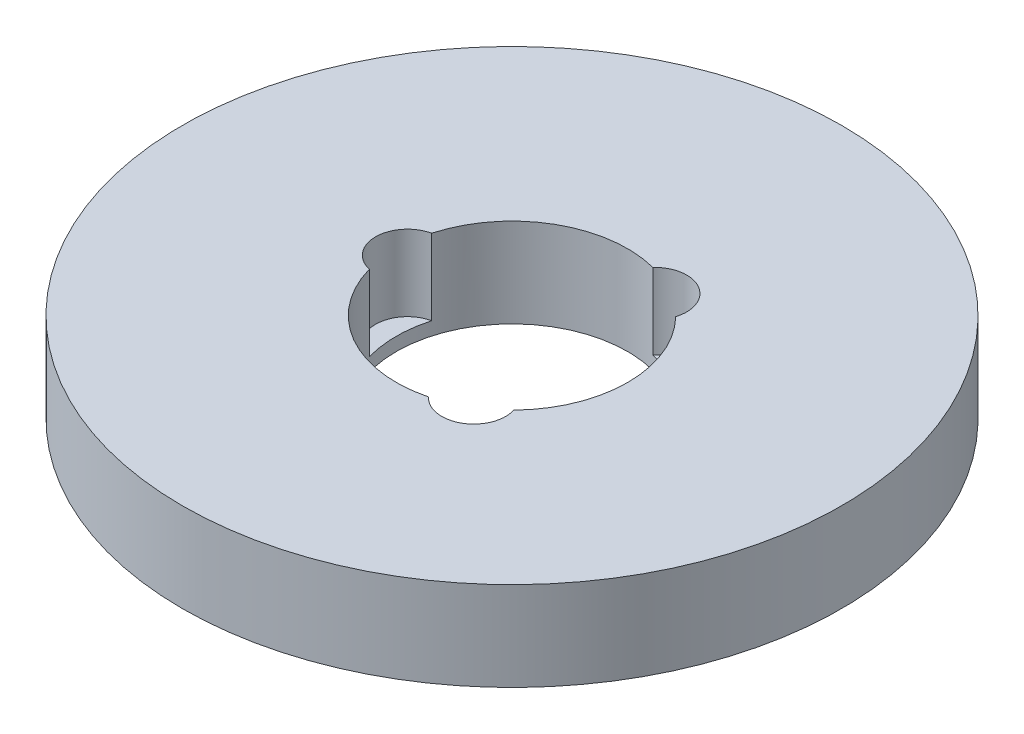
ISO-10303-21;
HEADER;
FILE_DESCRIPTION(('STEP AP214'),'2;1');
FILE_NAME('part.step','',(''),(''),'','','');
FILE_SCHEMA(('AUTOMOTIVE_DESIGN { 1 0 10303 214 1 1 1 1 }'));
ENDSEC;
DATA;
#1=APPLICATION_CONTEXT('core data for automotive mechanical design processes');
#2=APPLICATION_PROTOCOL_DEFINITION('international standard','automotive_design',2000,#1);
#3=PRODUCT_CONTEXT('',#1,'mechanical');
#4=PRODUCT('Part','Part','',(#3));
#5=PRODUCT_RELATED_PRODUCT_CATEGORY('part','',(#4));
#6=PRODUCT_DEFINITION_FORMATION('','',#4);
#7=PRODUCT_DEFINITION_CONTEXT('part definition',#1,'design');
#8=PRODUCT_DEFINITION('design','',#6,#7);
#9=PRODUCT_DEFINITION_SHAPE('','',#8);
#10=(LENGTH_UNIT() NAMED_UNIT(*) SI_UNIT(.MILLI.,.METRE.));
#11=(NAMED_UNIT(*) PLANE_ANGLE_UNIT() SI_UNIT($,.RADIAN.));
#12=(NAMED_UNIT(*) SI_UNIT($,.STERADIAN.) SOLID_ANGLE_UNIT());
#13=UNCERTAINTY_MEASURE_WITH_UNIT(LENGTH_MEASURE(1.E-05),#10,'distance_accuracy_value','');
#14=(GEOMETRIC_REPRESENTATION_CONTEXT(3) GLOBAL_UNCERTAINTY_ASSIGNED_CONTEXT((#13)) GLOBAL_UNIT_ASSIGNED_CONTEXT((#10,
#11,#12)) REPRESENTATION_CONTEXT('',''));
#15=CARTESIAN_POINT('',(0.,0.,0.));
#16=DIRECTION('',(0.,0.,1.));
#17=DIRECTION('',(1.,0.,0.));
#18=AXIS2_PLACEMENT_3D('',#15,#16,#17);
#19=CARTESIAN_POINT('',(0.,25.,0.));
#20=DIRECTION('',(0.,-1.,0.));
#21=DIRECTION('',(0.,0.,-1.));
#22=AXIS2_PLACEMENT_3D('',#19,#20,#21);
#23=CYLINDRICAL_SURFACE('',#22,92.5);
#24=CARTESIAN_POINT('',(0.,25.,0.));
#25=DIRECTION('',(0.,1.,0.));
#26=DIRECTION('',(0.,0.,1.));
#27=AXIS2_PLACEMENT_3D('',#24,#25,#26);
#28=CIRCLE('',#27,92.5);
#29=CARTESIAN_POINT('',(0.,25.,92.5));
#30=VERTEX_POINT('',#29);
#31=EDGE_CURVE('E130',#30,#30,#28,.T.);
#32=ORIENTED_EDGE('',*,*,#31,.F.);
#33=EDGE_LOOP('',(#32));
#34=FACE_BOUND('',#33,.T.);
#35=CARTESIAN_POINT('',(0.,0.,0.));
#36=DIRECTION('',(0.,1.,0.));
#37=DIRECTION('',(0.,0.,1.));
#38=AXIS2_PLACEMENT_3D('',#35,#36,#37);
#39=CIRCLE('',#38,92.5);
#40=CARTESIAN_POINT('',(0.,0.,92.5));
#41=VERTEX_POINT('',#40);
#42=EDGE_CURVE('E117',#41,#41,#39,.T.);
#43=ORIENTED_EDGE('',*,*,#42,.T.);
#44=EDGE_LOOP('',(#43));
#45=FACE_BOUND('',#44,.T.);
#46=ADVANCED_FACE('F39',(#34,#45),#23,.T.);
#47=CARTESIAN_POINT('',(0.,25.,0.));
#48=DIRECTION('',(0.,1.,0.));
#49=DIRECTION('',(0.,0.,1.));
#50=AXIS2_PLACEMENT_3D('',#47,#48,#49);
#51=PLANE('',#50);
#52=CARTESIAN_POINT('',(14.6615317858549,25.,25.3945179698865));
#53=DIRECTION('',(0.,1.,0.));
#54=DIRECTION('',(0.866025403784436,0.,-0.500000000000004));
#55=AXIS2_PLACEMENT_3D('',#52,#53,#54);
#56=CIRCLE('',#55,8.9815388974926);
#57=CARTESIAN_POINT('',(8.06015384169916,25.,31.4846616632312));
#58=VERTEX_POINT('',#57);
#59=CARTESIAN_POINT('',(23.2364399090669,25.,22.7226288169376));
#60=VERTEX_POINT('',#59);
#61=EDGE_CURVE('E148',#58,#60,#56,.T.);
#62=ORIENTED_EDGE('',*,*,#61,.F.);
#63=CARTESIAN_POINT('',(0.,25.,0.));
#64=DIRECTION('',(0.,1.,0.));
#65=DIRECTION('',(0.,0.,1.));
#66=AXIS2_PLACEMENT_3D('',#63,#64,#65);
#67=CIRCLE('',#66,32.5);
#68=CARTESIAN_POINT('',(-31.2965937507658,25.,8.76203284629355));
#69=VERTEX_POINT('',#68);
#70=EDGE_CURVE('E113',#69,#58,#67,.T.);
#71=ORIENTED_EDGE('',*,*,#70,.F.);
#72=CARTESIAN_POINT('',(-29.3230635717096,25.,0.));
#73=DIRECTION('',(0.,1.,0.));
#74=DIRECTION('',(0.,0.,1.));
#75=AXIS2_PLACEMENT_3D('',#72,#73,#74);
#76=CIRCLE('',#75,8.9815388974926);
#77=CARTESIAN_POINT('',(-31.2965937507658,25.,-8.76203284629355));
#78=VERTEX_POINT('',#77);
#79=EDGE_CURVE('E125',#78,#69,#76,.T.);
#80=ORIENTED_EDGE('',*,*,#79,.F.);
#81=CARTESIAN_POINT('',(8.06015384169872,25.,-31.4846616632313));
#82=VERTEX_POINT('',#81);
#83=EDGE_CURVE('E107',#82,#78,#67,.T.);
#84=ORIENTED_EDGE('',*,*,#83,.F.);
#85=CARTESIAN_POINT('',(14.6615317858546,25.,-25.3945179698867));
#86=DIRECTION('',(0.,1.,0.));
#87=DIRECTION('',(-0.866025403784443,0.,-0.499999999999992));
#88=AXIS2_PLACEMENT_3D('',#85,#86,#87);
#89=CIRCLE('',#88,8.9815388974926);
#90=CARTESIAN_POINT('',(23.2364399090666,25.,-22.7226288169379));
#91=VERTEX_POINT('',#90);
#92=EDGE_CURVE('E95',#91,#82,#89,.T.);
#93=ORIENTED_EDGE('',*,*,#92,.F.);
#94=EDGE_CURVE('E106',#60,#91,#67,.T.);
#95=ORIENTED_EDGE('',*,*,#94,.F.);
#96=EDGE_LOOP('',(#62,#71,#80,#84,#93,#95));
#97=FACE_BOUND('',#96,.T.);
#98=ORIENTED_EDGE('',*,*,#31,.T.);
#99=EDGE_LOOP('',(#98));
#100=FACE_BOUND('',#99,.T.);
#101=ADVANCED_FACE('F102',(#97,#100),#51,.T.);
#102=CARTESIAN_POINT('',(0.,0.,0.));
#103=DIRECTION('',(0.,1.,0.));
#104=DIRECTION('',(0.,0.,1.));
#105=AXIS2_PLACEMENT_3D('',#102,#103,#104);
#106=PLANE('',#105);
#107=CARTESIAN_POINT('',(0.,0.,0.));
#108=DIRECTION('',(0.,1.,0.));
#109=DIRECTION('',(0.,0.,1.));
#110=AXIS2_PLACEMENT_3D('',#107,#108,#109);
#111=CIRCLE('',#110,32.5);
#112=CARTESIAN_POINT('',(0.,0.,32.5));
#113=VERTEX_POINT('',#112);
#114=EDGE_CURVE('E118',#113,#113,#111,.T.);
#115=ORIENTED_EDGE('',*,*,#114,.T.);
#116=EDGE_LOOP('',(#115));
#117=FACE_BOUND('',#116,.T.);
#118=ORIENTED_EDGE('',*,*,#42,.F.);
#119=EDGE_LOOP('',(#118));
#120=FACE_BOUND('',#119,.T.);
#121=ADVANCED_FACE('F161',(#117,#120),#106,.F.);
#122=CARTESIAN_POINT('',(0.,25.,0.));
#123=DIRECTION('',(0.,-1.,0.));
#124=DIRECTION('',(0.,0.,-1.));
#125=AXIS2_PLACEMENT_3D('',#122,#123,#124);
#126=CYLINDRICAL_SURFACE('',#125,32.5);
#127=DIRECTION('',(0.,1.,0.));
#128=VECTOR('',#127,1.);
#129=CARTESIAN_POINT('',(8.06015384169915,14.3632524422824,31.4846616632312));
#130=LINE('',#129,#128);
#131=CARTESIAN_POINT('',(8.06015384169916,3.72650488456475,31.4846616632312));
#132=VERTEX_POINT('',#131);
#133=EDGE_CURVE('E11',#132,#58,#130,.T.);
#134=ORIENTED_EDGE('',*,*,#133,.F.);
#135=CARTESIAN_POINT('',(0.,3.72650488456475,0.));
#136=DIRECTION('',(0.,1.,0.));
#137=DIRECTION('',(0.,0.,1.));
#138=AXIS2_PLACEMENT_3D('',#135,#136,#137);
#139=CIRCLE('',#138,32.5);
#140=CARTESIAN_POINT('',(23.2364399090669,3.72650488456475,22.7226288169376));
#141=VERTEX_POINT('',#140);
#142=EDGE_CURVE('E100',#132,#141,#139,.T.);
#143=ORIENTED_EDGE('',*,*,#142,.T.);
#144=DIRECTION('',(0.,1.,0.));
#145=VECTOR('',#144,1.);
#146=CARTESIAN_POINT('',(23.2364399090669,14.3632524422824,22.7226288169376));
#147=LINE('',#146,#145);
#148=EDGE_CURVE('E46',#60,#141,#147,.F.);
#149=ORIENTED_EDGE('',*,*,#148,.F.);
#150=ORIENTED_EDGE('',*,*,#94,.T.);
#151=DIRECTION('',(0.,1.,0.));
#152=VECTOR('',#151,1.);
#153=CARTESIAN_POINT('',(23.2364399090666,14.3632524422824,-22.7226288169379));
#154=LINE('',#153,#152);
#155=CARTESIAN_POINT('',(23.2364399090666,3.72650488456475,-22.7226288169379));
#156=VERTEX_POINT('',#155);
#157=EDGE_CURVE('E90',#156,#91,#154,.T.);
#158=ORIENTED_EDGE('',*,*,#157,.F.);
#159=CARTESIAN_POINT('',(0.,3.72650488456475,0.));
#160=DIRECTION('',(0.,1.,0.));
#161=DIRECTION('',(0.,0.,1.));
#162=AXIS2_PLACEMENT_3D('',#159,#160,#161);
#163=CIRCLE('',#162,32.5);
#164=CARTESIAN_POINT('',(8.06015384169872,3.72650488456475,-31.4846616632313));
#165=VERTEX_POINT('',#164);
#166=EDGE_CURVE('E143',#156,#165,#163,.T.);
#167=ORIENTED_EDGE('',*,*,#166,.T.);
#168=DIRECTION('',(0.,1.,0.));
#169=VECTOR('',#168,1.);
#170=CARTESIAN_POINT('',(8.06015384169872,14.3632524422824,-31.4846616632313));
#171=LINE('',#170,#169);
#172=EDGE_CURVE('E98',#82,#165,#171,.F.);
#173=ORIENTED_EDGE('',*,*,#172,.F.);
#174=ORIENTED_EDGE('',*,*,#83,.T.);
#175=DIRECTION('',(0.,1.,0.));
#176=VECTOR('',#175,1.);
#177=CARTESIAN_POINT('',(-31.2965937507658,14.3632524422824,-8.76203284629355));
#178=LINE('',#177,#176);
#179=CARTESIAN_POINT('',(-31.2965937507658,3.72650488456475,-8.76203284629355));
#180=VERTEX_POINT('',#179);
#181=EDGE_CURVE('E137',#180,#78,#178,.T.);
#182=ORIENTED_EDGE('',*,*,#181,.F.);
#183=CARTESIAN_POINT('',(0.,3.72650488456475,0.));
#184=DIRECTION('',(0.,1.,0.));
#185=DIRECTION('',(0.,0.,1.));
#186=AXIS2_PLACEMENT_3D('',#183,#184,#185);
#187=CIRCLE('',#186,32.5);
#188=CARTESIAN_POINT('',(-31.2965937507658,3.72650488456475,8.76203284629355));
#189=VERTEX_POINT('',#188);
#190=EDGE_CURVE('E128',#180,#189,#187,.T.);
#191=ORIENTED_EDGE('',*,*,#190,.T.);
#192=DIRECTION('',(0.,1.,0.));
#193=VECTOR('',#192,1.);
#194=CARTESIAN_POINT('',(-31.2965937507658,14.3632524422824,8.76203284629355));
#195=LINE('',#194,#193);
#196=EDGE_CURVE('E134',#69,#189,#195,.F.);
#197=ORIENTED_EDGE('',*,*,#196,.F.);
#198=ORIENTED_EDGE('',*,*,#70,.T.);
#199=EDGE_LOOP('',(#134,#143,#149,#150,#158,#167,#173,#174,#182,#191,#197,#198));
#200=FACE_BOUND('',#199,.T.);
#201=ORIENTED_EDGE('',*,*,#114,.F.);
#202=EDGE_LOOP('',(#201));
#203=FACE_BOUND('',#202,.T.);
#204=ADVANCED_FACE('F115',(#200,#203),#126,.F.);
#205=CARTESIAN_POINT('',(-29.3230635717096,3.72650488456475,0.));
#206=DIRECTION('',(0.,1.,0.));
#207=DIRECTION('',(0.,0.,1.));
#208=AXIS2_PLACEMENT_3D('',#205,#206,#207);
#209=CYLINDRICAL_SURFACE('',#208,8.9815388974926);
#210=ORIENTED_EDGE('',*,*,#181,.T.);
#211=ORIENTED_EDGE('',*,*,#79,.T.);
#212=ORIENTED_EDGE('',*,*,#196,.T.);
#213=CARTESIAN_POINT('',(-29.3230635717096,3.72650488456475,0.));
#214=DIRECTION('',(0.,1.,0.));
#215=DIRECTION('',(0.,0.,1.));
#216=AXIS2_PLACEMENT_3D('',#213,#214,#215);
#217=CIRCLE('',#216,8.9815388974926);
#218=EDGE_CURVE('E127',#180,#189,#217,.T.);
#219=ORIENTED_EDGE('',*,*,#218,.F.);
#220=EDGE_LOOP('',(#210,#211,#212,#219));
#221=FACE_BOUND('',#220,.T.);
#222=ADVANCED_FACE('F175',(#221),#209,.F.);
#223=CARTESIAN_POINT('',(-29.3230635717096,3.72650488456475,0.));
#224=DIRECTION('',(0.,1.,0.));
#225=DIRECTION('',(0.,0.,1.));
#226=AXIS2_PLACEMENT_3D('',#223,#224,#225);
#227=PLANE('',#226);
#228=ORIENTED_EDGE('',*,*,#218,.T.);
#229=ORIENTED_EDGE('',*,*,#190,.F.);
#230=EDGE_LOOP('',(#228,#229));
#231=FACE_BOUND('',#230,.T.);
#232=ADVANCED_FACE('F176',(#231),#227,.T.);
#233=CARTESIAN_POINT('',(14.6615317858546,3.72650488456475,-25.3945179698867));
#234=DIRECTION('',(0.,1.,0.));
#235=DIRECTION('',(0.,0.,1.));
#236=AXIS2_PLACEMENT_3D('',#233,#234,#235);
#237=CYLINDRICAL_SURFACE('',#236,8.9815388974926);
#238=ORIENTED_EDGE('',*,*,#157,.T.);
#239=ORIENTED_EDGE('',*,*,#92,.T.);
#240=ORIENTED_EDGE('',*,*,#172,.T.);
#241=CARTESIAN_POINT('',(14.6615317858546,3.72650488456475,-25.3945179698867));
#242=DIRECTION('',(0.,1.,0.));
#243=DIRECTION('',(-0.866025403784443,0.,-0.499999999999992));
#244=AXIS2_PLACEMENT_3D('',#241,#242,#243);
#245=CIRCLE('',#244,8.9815388974926);
#246=EDGE_CURVE('E56',#156,#165,#245,.T.);
#247=ORIENTED_EDGE('',*,*,#246,.F.);
#248=EDGE_LOOP('',(#238,#239,#240,#247));
#249=FACE_BOUND('',#248,.T.);
#250=ADVANCED_FACE('F93',(#249),#237,.F.);
#251=CARTESIAN_POINT('',(14.6615317858546,3.72650488456475,-25.3945179698867));
#252=DIRECTION('',(0.,1.,0.));
#253=DIRECTION('',(-0.866025403784443,0.,-0.499999999999992));
#254=AXIS2_PLACEMENT_3D('',#251,#252,#253);
#255=PLANE('',#254);
#256=ORIENTED_EDGE('',*,*,#246,.T.);
#257=ORIENTED_EDGE('',*,*,#166,.F.);
#258=EDGE_LOOP('',(#256,#257));
#259=FACE_BOUND('',#258,.T.);
#260=ADVANCED_FACE('F153',(#259),#255,.T.);
#261=CARTESIAN_POINT('',(14.6615317858549,3.72650488456475,25.3945179698865));
#262=DIRECTION('',(0.,1.,0.));
#263=DIRECTION('',(0.,0.,1.));
#264=AXIS2_PLACEMENT_3D('',#261,#262,#263);
#265=CYLINDRICAL_SURFACE('',#264,8.9815388974926);
#266=ORIENTED_EDGE('',*,*,#133,.T.);
#267=ORIENTED_EDGE('',*,*,#61,.T.);
#268=ORIENTED_EDGE('',*,*,#148,.T.);
#269=CARTESIAN_POINT('',(14.6615317858549,3.72650488456475,25.3945179698865));
#270=DIRECTION('',(0.,1.,0.));
#271=DIRECTION('',(0.866025403784436,0.,-0.500000000000004));
#272=AXIS2_PLACEMENT_3D('',#269,#270,#271);
#273=CIRCLE('',#272,8.9815388974926);
#274=EDGE_CURVE('E55',#132,#141,#273,.T.);
#275=ORIENTED_EDGE('',*,*,#274,.F.);
#276=EDGE_LOOP('',(#266,#267,#268,#275));
#277=FACE_BOUND('',#276,.T.);
#278=ADVANCED_FACE('F144',(#277),#265,.F.);
#279=CARTESIAN_POINT('',(14.6615317858549,3.72650488456475,25.3945179698865));
#280=DIRECTION('',(0.,1.,0.));
#281=DIRECTION('',(0.866025403784436,0.,-0.500000000000004));
#282=AXIS2_PLACEMENT_3D('',#279,#280,#281);
#283=PLANE('',#282);
#284=ORIENTED_EDGE('',*,*,#274,.T.);
#285=ORIENTED_EDGE('',*,*,#142,.F.);
#286=EDGE_LOOP('',(#284,#285));
#287=FACE_BOUND('',#286,.T.);
#288=ADVANCED_FACE('F150',(#287),#283,.T.);
#289=CLOSED_SHELL('',(#46,#101,#121,#204,#222,#232,#250,#260,#278,#288));
#290=MANIFOLD_SOLID_BREP('B2',#289);
#291=ADVANCED_BREP_SHAPE_REPRESENTATION('',(#18,#290),#14);
#292=SHAPE_DEFINITION_REPRESENTATION(#9,#291);
ENDSEC;
END-ISO-10303-21;
